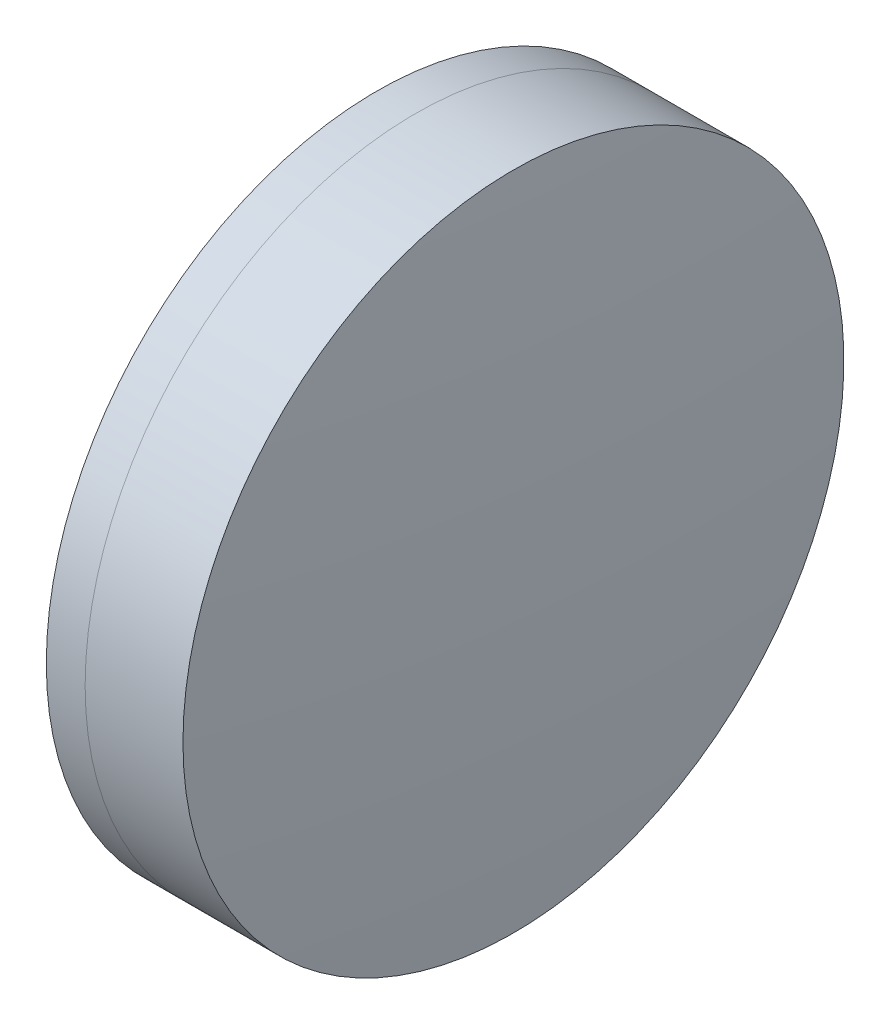
ISO-10303-21;
HEADER;
FILE_DESCRIPTION(('STEP AP214'),'2;1');
FILE_NAME('part.step','',(''),(''),'','','');
FILE_SCHEMA(('AUTOMOTIVE_DESIGN { 1 0 10303 214 1 1 1 1 }'));
ENDSEC;
DATA;
#1=APPLICATION_CONTEXT('core data for automotive mechanical design processes');
#2=APPLICATION_PROTOCOL_DEFINITION('international standard','automotive_design',2000,#1);
#3=PRODUCT_CONTEXT('',#1,'mechanical');
#4=PRODUCT('Part','Part','',(#3));
#5=PRODUCT_RELATED_PRODUCT_CATEGORY('part','',(#4));
#6=PRODUCT_DEFINITION_FORMATION('','',#4);
#7=PRODUCT_DEFINITION_CONTEXT('part definition',#1,'design');
#8=PRODUCT_DEFINITION('design','',#6,#7);
#9=PRODUCT_DEFINITION_SHAPE('','',#8);
#10=(LENGTH_UNIT() NAMED_UNIT(*) SI_UNIT(.MILLI.,.METRE.));
#11=(NAMED_UNIT(*) PLANE_ANGLE_UNIT() SI_UNIT($,.RADIAN.));
#12=(NAMED_UNIT(*) SI_UNIT($,.STERADIAN.) SOLID_ANGLE_UNIT());
#13=UNCERTAINTY_MEASURE_WITH_UNIT(LENGTH_MEASURE(1.E-05),#10,'distance_accuracy_value','');
#14=(GEOMETRIC_REPRESENTATION_CONTEXT(3) GLOBAL_UNCERTAINTY_ASSIGNED_CONTEXT((#13)) GLOBAL_UNIT_ASSIGNED_CONTEXT((#10,
#11,#12)) REPRESENTATION_CONTEXT('',''));
#15=CARTESIAN_POINT('',(0.,0.,0.));
#16=DIRECTION('',(0.,0.,1.));
#17=DIRECTION('',(1.,0.,0.));
#18=AXIS2_PLACEMENT_3D('',#15,#16,#17);
#19=CARTESIAN_POINT('',(211.095845808419,0.,0.));
#20=DIRECTION('',(-1.,0.,0.));
#21=DIRECTION('',(0.,0.,1.));
#22=AXIS2_PLACEMENT_3D('',#19,#20,#21);
#23=SPHERICAL_SURFACE('',#22,55.9);
#24=CARTESIAN_POINT('',(265.534067675045,0.,0.));
#25=DIRECTION('',(-1.,0.,0.));
#26=DIRECTION('',(0.,0.,1.));
#27=AXIS2_PLACEMENT_3D('',#24,#25,#26);
#28=CIRCLE('',#27,12.7);
#29=CARTESIAN_POINT('',(265.534067675045,0.,12.7));
#30=VERTEX_POINT('',#29);
#31=EDGE_CURVE('E11',#30,#30,#28,.T.);
#32=ORIENTED_EDGE('',*,*,#31,.T.);
#33=EDGE_LOOP('',(#32));
#34=FACE_BOUND('',#33,.T.);
#35=ADVANCED_FACE('F43',(#34),#23,.F.);
#36=CARTESIAN_POINT('',(-0.551919992657797,0.,0.));
#37=DIRECTION('',(-1.,0.,0.));
#38=DIRECTION('',(0.,0.,1.));
#39=AXIS2_PLACEMENT_3D('',#36,#37,#38);
#40=CYLINDRICAL_SURFACE('',#39,12.7);
#41=CARTESIAN_POINT('',(269.293537619624,0.,0.));
#42=DIRECTION('',(-1.,0.,0.));
#43=DIRECTION('',(0.,0.,1.));
#44=AXIS2_PLACEMENT_3D('',#41,#42,#43);
#45=CIRCLE('',#44,12.7);
#46=CARTESIAN_POINT('',(269.293537619624,0.,12.7));
#47=VERTEX_POINT('',#46);
#48=EDGE_CURVE('E49',#47,#47,#45,.T.);
#49=ORIENTED_EDGE('',*,*,#48,.T.);
#50=EDGE_LOOP('',(#49));
#51=FACE_BOUND('',#50,.T.);
#52=ORIENTED_EDGE('',*,*,#31,.F.);
#53=EDGE_LOOP('',(#52));
#54=FACE_BOUND('',#53,.T.);
#55=ADVANCED_FACE('F55',(#51,#54),#40,.T.);
#56=CARTESIAN_POINT('',(108.995845808419,0.,0.));
#57=DIRECTION('',(-1.,0.,0.));
#58=DIRECTION('',(0.,0.,1.));
#59=AXIS2_PLACEMENT_3D('',#56,#57,#58);
#60=SPHERICAL_SURFACE('',#59,160.8);
#61=ORIENTED_EDGE('',*,*,#48,.F.);
#62=EDGE_LOOP('',(#61));
#63=FACE_BOUND('',#62,.T.);
#64=ADVANCED_FACE('F58',(#63),#60,.T.);
#65=CLOSED_SHELL('',(#35,#55,#64));
#66=MANIFOLD_SOLID_BREP('B2',#65);
#67=CARTESIAN_POINT('',(340.595845808419,0.,0.));
#68=DIRECTION('',(-1.,0.,0.));
#69=DIRECTION('',(0.,0.,1.));
#70=AXIS2_PLACEMENT_3D('',#67,#68,#69);
#71=SPHERICAL_SURFACE('',#70,77.6);
#72=CARTESIAN_POINT('',(264.04213917053,0.,0.));
#73=DIRECTION('',(-1.,0.,0.));
#74=DIRECTION('',(0.,0.,1.));
#75=AXIS2_PLACEMENT_3D('',#72,#73,#74);
#76=CIRCLE('',#75,12.7);
#77=CARTESIAN_POINT('',(264.04213917053,0.,12.7));
#78=VERTEX_POINT('',#77);
#79=EDGE_CURVE('E42',#78,#78,#76,.T.);
#80=ORIENTED_EDGE('',*,*,#79,.T.);
#81=EDGE_LOOP('',(#80));
#82=FACE_BOUND('',#81,.T.);
#83=ADVANCED_FACE('F84',(#82),#71,.T.);
#84=CARTESIAN_POINT('',(235.807450690754,0.,0.));
#85=DIRECTION('',(-1.,0.,0.));
#86=DIRECTION('',(0.,0.,1.));
#87=AXIS2_PLACEMENT_3D('',#84,#85,#86);
#88=CYLINDRICAL_SURFACE('',#87,12.7);
#89=CARTESIAN_POINT('',(265.534067675045,0.,0.));
#90=DIRECTION('',(-1.,0.,0.));
#91=DIRECTION('',(0.,0.,1.));
#92=AXIS2_PLACEMENT_3D('',#89,#90,#91);
#93=CIRCLE('',#92,12.7);
#94=CARTESIAN_POINT('',(265.534067675045,0.,12.7));
#95=VERTEX_POINT('',#94);
#96=EDGE_CURVE('E90',#95,#95,#93,.T.);
#97=ORIENTED_EDGE('',*,*,#96,.T.);
#98=EDGE_LOOP('',(#97));
#99=FACE_BOUND('',#98,.T.);
#100=ORIENTED_EDGE('',*,*,#79,.F.);
#101=EDGE_LOOP('',(#100));
#102=FACE_BOUND('',#101,.T.);
#103=ADVANCED_FACE('F96',(#99,#102),#88,.T.);
#104=CARTESIAN_POINT('',(211.095845808419,0.,0.));
#105=DIRECTION('',(-1.,0.,0.));
#106=DIRECTION('',(0.,0.,1.));
#107=AXIS2_PLACEMENT_3D('',#104,#105,#106);
#108=SPHERICAL_SURFACE('',#107,55.9);
#109=ORIENTED_EDGE('',*,*,#96,.F.);
#110=EDGE_LOOP('',(#109));
#111=FACE_BOUND('',#110,.T.);
#112=ADVANCED_FACE('F99',(#111),#108,.T.);
#113=CLOSED_SHELL('',(#83,#103,#112));
#114=MANIFOLD_SOLID_BREP('B6',#113);
#115=ADVANCED_BREP_SHAPE_REPRESENTATION('',(#18,#66,#114),#14);
#116=SHAPE_DEFINITION_REPRESENTATION(#9,#115);
ENDSEC;
END-ISO-10303-21;
